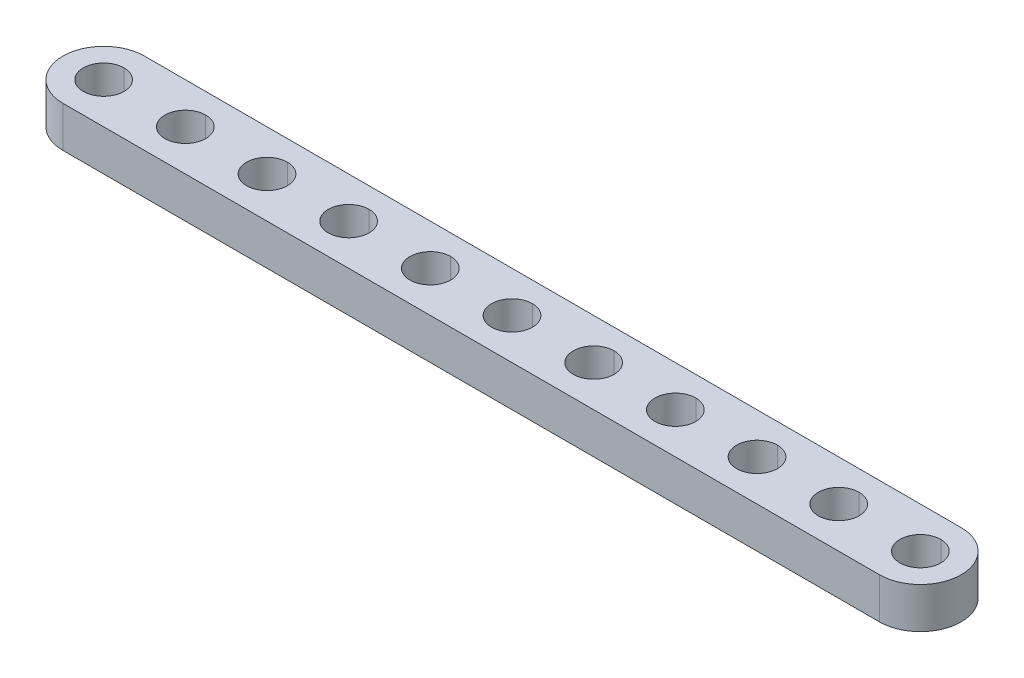
ISO-10303-21;
HEADER;
FILE_DESCRIPTION(('STEP AP214'),'2;1');
FILE_NAME('part.step','',(''),(''),'','','');
FILE_SCHEMA(('AUTOMOTIVE_DESIGN { 1 0 10303 214 1 1 1 1 }'));
ENDSEC;
DATA;
#1=APPLICATION_CONTEXT('core data for automotive mechanical design processes');
#2=APPLICATION_PROTOCOL_DEFINITION('international standard','automotive_design',2000,#1);
#3=PRODUCT_CONTEXT('',#1,'mechanical');
#4=PRODUCT('Part','Part','',(#3));
#5=PRODUCT_RELATED_PRODUCT_CATEGORY('part','',(#4));
#6=PRODUCT_DEFINITION_FORMATION('','',#4);
#7=PRODUCT_DEFINITION_CONTEXT('part definition',#1,'design');
#8=PRODUCT_DEFINITION('design','',#6,#7);
#9=PRODUCT_DEFINITION_SHAPE('','',#8);
#10=(LENGTH_UNIT() NAMED_UNIT(*) SI_UNIT(.MILLI.,.METRE.));
#11=(NAMED_UNIT(*) PLANE_ANGLE_UNIT() SI_UNIT($,.RADIAN.));
#12=(NAMED_UNIT(*) SI_UNIT($,.STERADIAN.) SOLID_ANGLE_UNIT());
#13=UNCERTAINTY_MEASURE_WITH_UNIT(LENGTH_MEASURE(1.E-05),#10,'distance_accuracy_value','');
#14=(GEOMETRIC_REPRESENTATION_CONTEXT(3) GLOBAL_UNCERTAINTY_ASSIGNED_CONTEXT((#13)) GLOBAL_UNIT_ASSIGNED_CONTEXT((#10,
#11,#12)) REPRESENTATION_CONTEXT('',''));
#15=CARTESIAN_POINT('',(0.,0.,0.));
#16=DIRECTION('',(0.,0.,1.));
#17=DIRECTION('',(1.,0.,0.));
#18=AXIS2_PLACEMENT_3D('',#15,#16,#17);
#19=CARTESIAN_POINT('',(40.,4.,0.));
#20=DIRECTION('',(0.,1.,0.));
#21=DIRECTION('',(0.,0.,1.));
#22=AXIS2_PLACEMENT_3D('',#19,#20,#21);
#23=CYLINDRICAL_SURFACE('',#22,2.);
#24=DIRECTION('',(0.,1.,0.));
#25=VECTOR('',#24,1.);
#26=CARTESIAN_POINT('',(40.,4.,-2.));
#27=LINE('',#26,#25);
#28=CARTESIAN_POINT('',(40.,0.,-2.));
#29=VERTEX_POINT('',#28);
#30=CARTESIAN_POINT('',(40.,4.,-2.));
#31=VERTEX_POINT('',#30);
#32=EDGE_CURVE('E334',#29,#31,#27,.T.);
#33=ORIENTED_EDGE('',*,*,#32,.F.);
#34=CARTESIAN_POINT('',(40.,0.,0.));
#35=DIRECTION('',(0.,1.,0.));
#36=DIRECTION('',(0.,0.,1.));
#37=AXIS2_PLACEMENT_3D('',#34,#35,#36);
#38=CIRCLE('',#37,2.);
#39=CARTESIAN_POINT('',(40.,0.,2.));
#40=VERTEX_POINT('',#39);
#41=EDGE_CURVE('E340',#40,#29,#38,.T.);
#42=ORIENTED_EDGE('',*,*,#41,.F.);
#43=DIRECTION('',(0.,1.,0.));
#44=VECTOR('',#43,1.);
#45=CARTESIAN_POINT('',(40.,4.,2.));
#46=LINE('',#45,#44);
#47=CARTESIAN_POINT('',(40.,4.,2.));
#48=VERTEX_POINT('',#47);
#49=EDGE_CURVE('E371',#40,#48,#46,.T.);
#50=ORIENTED_EDGE('',*,*,#49,.T.);
#51=CARTESIAN_POINT('',(40.,4.,0.));
#52=DIRECTION('',(0.,1.,0.));
#53=DIRECTION('',(0.,0.,1.));
#54=AXIS2_PLACEMENT_3D('',#51,#52,#53);
#55=CIRCLE('',#54,2.);
#56=EDGE_CURVE('E259',#48,#31,#55,.T.);
#57=ORIENTED_EDGE('',*,*,#56,.T.);
#58=EDGE_LOOP('',(#33,#42,#50,#57));
#59=FACE_BOUND('',#58,.T.);
#60=ADVANCED_FACE('F14',(#59),#23,.F.);
#61=CARTESIAN_POINT('',(32.,4.,0.));
#62=DIRECTION('',(0.,1.,0.));
#63=DIRECTION('',(0.,0.,1.));
#64=AXIS2_PLACEMENT_3D('',#61,#62,#63);
#65=CYLINDRICAL_SURFACE('',#64,2.);
#66=DIRECTION('',(0.,1.,0.));
#67=VECTOR('',#66,1.);
#68=CARTESIAN_POINT('',(32.,4.,-2.));
#69=LINE('',#68,#67);
#70=CARTESIAN_POINT('',(32.,0.,-2.));
#71=VERTEX_POINT('',#70);
#72=CARTESIAN_POINT('',(32.,4.,-2.));
#73=VERTEX_POINT('',#72);
#74=EDGE_CURVE('E329',#71,#73,#69,.T.);
#75=ORIENTED_EDGE('',*,*,#74,.F.);
#76=CARTESIAN_POINT('',(32.,0.,0.));
#77=DIRECTION('',(0.,1.,0.));
#78=DIRECTION('',(0.,0.,1.));
#79=AXIS2_PLACEMENT_3D('',#76,#77,#78);
#80=CIRCLE('',#79,2.);
#81=CARTESIAN_POINT('',(32.,0.,2.));
#82=VERTEX_POINT('',#81);
#83=EDGE_CURVE('E335',#82,#71,#80,.T.);
#84=ORIENTED_EDGE('',*,*,#83,.F.);
#85=DIRECTION('',(0.,1.,0.));
#86=VECTOR('',#85,1.);
#87=CARTESIAN_POINT('',(32.,4.,2.));
#88=LINE('',#87,#86);
#89=CARTESIAN_POINT('',(32.,4.,2.));
#90=VERTEX_POINT('',#89);
#91=EDGE_CURVE('E266',#82,#90,#88,.T.);
#92=ORIENTED_EDGE('',*,*,#91,.T.);
#93=CARTESIAN_POINT('',(32.,4.,0.));
#94=DIRECTION('',(0.,1.,0.));
#95=DIRECTION('',(0.,0.,1.));
#96=AXIS2_PLACEMENT_3D('',#93,#94,#95);
#97=CIRCLE('',#96,2.);
#98=EDGE_CURVE('E261',#90,#73,#97,.T.);
#99=ORIENTED_EDGE('',*,*,#98,.T.);
#100=EDGE_LOOP('',(#75,#84,#92,#99));
#101=FACE_BOUND('',#100,.T.);
#102=ADVANCED_FACE('F563',(#101),#65,.F.);
#103=CARTESIAN_POINT('',(24.,4.,0.));
#104=DIRECTION('',(0.,1.,0.));
#105=DIRECTION('',(0.,0.,1.));
#106=AXIS2_PLACEMENT_3D('',#103,#104,#105);
#107=CYLINDRICAL_SURFACE('',#106,2.);
#108=DIRECTION('',(0.,1.,0.));
#109=VECTOR('',#108,1.);
#110=CARTESIAN_POINT('',(24.,4.,-2.));
#111=LINE('',#110,#109);
#112=CARTESIAN_POINT('',(24.,0.,-2.));
#113=VERTEX_POINT('',#112);
#114=CARTESIAN_POINT('',(24.,4.,-2.));
#115=VERTEX_POINT('',#114);
#116=EDGE_CURVE('E452',#113,#115,#111,.T.);
#117=ORIENTED_EDGE('',*,*,#116,.F.);
#118=CARTESIAN_POINT('',(24.,0.,0.));
#119=DIRECTION('',(0.,1.,0.));
#120=DIRECTION('',(0.,0.,1.));
#121=AXIS2_PLACEMENT_3D('',#118,#119,#120);
#122=CIRCLE('',#121,2.);
#123=CARTESIAN_POINT('',(24.,0.,2.));
#124=VERTEX_POINT('',#123);
#125=EDGE_CURVE('E339',#124,#113,#122,.T.);
#126=ORIENTED_EDGE('',*,*,#125,.F.);
#127=DIRECTION('',(0.,1.,0.));
#128=VECTOR('',#127,1.);
#129=CARTESIAN_POINT('',(24.,4.,2.));
#130=LINE('',#129,#128);
#131=CARTESIAN_POINT('',(24.,4.,2.));
#132=VERTEX_POINT('',#131);
#133=EDGE_CURVE('E379',#124,#132,#130,.T.);
#134=ORIENTED_EDGE('',*,*,#133,.T.);
#135=CARTESIAN_POINT('',(24.,4.,0.));
#136=DIRECTION('',(0.,1.,0.));
#137=DIRECTION('',(0.,0.,1.));
#138=AXIS2_PLACEMENT_3D('',#135,#136,#137);
#139=CIRCLE('',#138,2.);
#140=EDGE_CURVE('E262',#132,#115,#139,.T.);
#141=ORIENTED_EDGE('',*,*,#140,.T.);
#142=EDGE_LOOP('',(#117,#126,#134,#141));
#143=FACE_BOUND('',#142,.T.);
#144=ADVANCED_FACE('F569',(#143),#107,.F.);
#145=CARTESIAN_POINT('',(16.,4.,0.));
#146=DIRECTION('',(0.,1.,0.));
#147=DIRECTION('',(0.,0.,1.));
#148=AXIS2_PLACEMENT_3D('',#145,#146,#147);
#149=CYLINDRICAL_SURFACE('',#148,2.);
#150=DIRECTION('',(0.,1.,0.));
#151=VECTOR('',#150,1.);
#152=CARTESIAN_POINT('',(16.,4.,-2.));
#153=LINE('',#152,#151);
#154=CARTESIAN_POINT('',(16.,0.,-2.));
#155=VERTEX_POINT('',#154);
#156=CARTESIAN_POINT('',(16.,4.,-2.));
#157=VERTEX_POINT('',#156);
#158=EDGE_CURVE('E394',#155,#157,#153,.T.);
#159=ORIENTED_EDGE('',*,*,#158,.F.);
#160=CARTESIAN_POINT('',(16.,0.,0.));
#161=DIRECTION('',(0.,1.,0.));
#162=DIRECTION('',(0.,0.,1.));
#163=AXIS2_PLACEMENT_3D('',#160,#161,#162);
#164=CIRCLE('',#163,2.);
#165=CARTESIAN_POINT('',(16.,0.,2.));
#166=VERTEX_POINT('',#165);
#167=EDGE_CURVE('E230',#166,#155,#164,.T.);
#168=ORIENTED_EDGE('',*,*,#167,.F.);
#169=DIRECTION('',(0.,1.,0.));
#170=VECTOR('',#169,1.);
#171=CARTESIAN_POINT('',(16.,4.,2.));
#172=LINE('',#171,#170);
#173=CARTESIAN_POINT('',(16.,4.,2.));
#174=VERTEX_POINT('',#173);
#175=EDGE_CURVE('E243',#166,#174,#172,.T.);
#176=ORIENTED_EDGE('',*,*,#175,.T.);
#177=CARTESIAN_POINT('',(16.,4.,0.));
#178=DIRECTION('',(0.,1.,0.));
#179=DIRECTION('',(0.,0.,1.));
#180=AXIS2_PLACEMENT_3D('',#177,#178,#179);
#181=CIRCLE('',#180,2.);
#182=EDGE_CURVE('E265',#174,#157,#181,.T.);
#183=ORIENTED_EDGE('',*,*,#182,.T.);
#184=EDGE_LOOP('',(#159,#168,#176,#183));
#185=FACE_BOUND('',#184,.T.);
#186=ADVANCED_FACE('F587',(#185),#149,.F.);
#187=CARTESIAN_POINT('',(8.,4.,0.));
#188=DIRECTION('',(0.,1.,0.));
#189=DIRECTION('',(0.,0.,1.));
#190=AXIS2_PLACEMENT_3D('',#187,#188,#189);
#191=CYLINDRICAL_SURFACE('',#190,2.);
#192=DIRECTION('',(0.,1.,0.));
#193=VECTOR('',#192,1.);
#194=CARTESIAN_POINT('',(8.,4.,-2.));
#195=LINE('',#194,#193);
#196=CARTESIAN_POINT('',(8.,0.,-2.));
#197=VERTEX_POINT('',#196);
#198=CARTESIAN_POINT('',(8.,4.,-2.));
#199=VERTEX_POINT('',#198);
#200=EDGE_CURVE('E224',#197,#199,#195,.T.);
#201=ORIENTED_EDGE('',*,*,#200,.F.);
#202=CARTESIAN_POINT('',(8.,0.,0.));
#203=DIRECTION('',(0.,1.,0.));
#204=DIRECTION('',(0.,0.,1.));
#205=AXIS2_PLACEMENT_3D('',#202,#203,#204);
#206=CIRCLE('',#205,2.);
#207=CARTESIAN_POINT('',(8.,0.,2.));
#208=VERTEX_POINT('',#207);
#209=EDGE_CURVE('E218',#208,#197,#206,.T.);
#210=ORIENTED_EDGE('',*,*,#209,.F.);
#211=DIRECTION('',(0.,1.,0.));
#212=VECTOR('',#211,1.);
#213=CARTESIAN_POINT('',(8.,4.,2.));
#214=LINE('',#213,#212);
#215=CARTESIAN_POINT('',(8.,4.,2.));
#216=VERTEX_POINT('',#215);
#217=EDGE_CURVE('E221',#208,#216,#214,.T.);
#218=ORIENTED_EDGE('',*,*,#217,.T.);
#219=CARTESIAN_POINT('',(8.,4.,0.));
#220=DIRECTION('',(0.,1.,0.));
#221=DIRECTION('',(0.,0.,1.));
#222=AXIS2_PLACEMENT_3D('',#219,#220,#221);
#223=CIRCLE('',#222,2.);
#224=EDGE_CURVE('E323',#216,#199,#223,.T.);
#225=ORIENTED_EDGE('',*,*,#224,.T.);
#226=EDGE_LOOP('',(#201,#210,#218,#225));
#227=FACE_BOUND('',#226,.T.);
#228=ADVANCED_FACE('F220',(#227),#191,.F.);
#229=CARTESIAN_POINT('',(0.,4.,0.));
#230=DIRECTION('',(0.,1.,0.));
#231=DIRECTION('',(0.,0.,1.));
#232=AXIS2_PLACEMENT_3D('',#229,#230,#231);
#233=CYLINDRICAL_SURFACE('',#232,2.);
#234=DIRECTION('',(0.,1.,0.));
#235=VECTOR('',#234,1.);
#236=CARTESIAN_POINT('',(0.,4.,-2.));
#237=LINE('',#236,#235);
#238=CARTESIAN_POINT('',(0.,0.,-2.));
#239=VERTEX_POINT('',#238);
#240=CARTESIAN_POINT('',(0.,4.,-2.));
#241=VERTEX_POINT('',#240);
#242=EDGE_CURVE('E283',#239,#241,#237,.T.);
#243=ORIENTED_EDGE('',*,*,#242,.F.);
#244=CARTESIAN_POINT('',(0.,0.,0.));
#245=DIRECTION('',(0.,1.,0.));
#246=DIRECTION('',(0.,0.,1.));
#247=AXIS2_PLACEMENT_3D('',#244,#245,#246);
#248=CIRCLE('',#247,2.);
#249=CARTESIAN_POINT('',(0.,0.,2.));
#250=VERTEX_POINT('',#249);
#251=EDGE_CURVE('E229',#250,#239,#248,.T.);
#252=ORIENTED_EDGE('',*,*,#251,.F.);
#253=DIRECTION('',(0.,1.,0.));
#254=VECTOR('',#253,1.);
#255=CARTESIAN_POINT('',(0.,4.,2.));
#256=LINE('',#255,#254);
#257=CARTESIAN_POINT('',(0.,4.,2.));
#258=VERTEX_POINT('',#257);
#259=EDGE_CURVE('E301',#250,#258,#256,.T.);
#260=ORIENTED_EDGE('',*,*,#259,.T.);
#261=CARTESIAN_POINT('',(0.,4.,0.));
#262=DIRECTION('',(0.,1.,0.));
#263=DIRECTION('',(0.,0.,1.));
#264=AXIS2_PLACEMENT_3D('',#261,#262,#263);
#265=CIRCLE('',#264,2.);
#266=EDGE_CURVE('E319',#258,#241,#265,.T.);
#267=ORIENTED_EDGE('',*,*,#266,.T.);
#268=EDGE_LOOP('',(#243,#252,#260,#267));
#269=FACE_BOUND('',#268,.T.);
#270=ADVANCED_FACE('F579',(#269),#233,.F.);
#271=CARTESIAN_POINT('',(-8.,4.,0.));
#272=DIRECTION('',(0.,1.,0.));
#273=DIRECTION('',(0.,0.,1.));
#274=AXIS2_PLACEMENT_3D('',#271,#272,#273);
#275=CYLINDRICAL_SURFACE('',#274,2.);
#276=DIRECTION('',(0.,1.,0.));
#277=VECTOR('',#276,1.);
#278=CARTESIAN_POINT('',(-8.,4.,-2.));
#279=LINE('',#278,#277);
#280=CARTESIAN_POINT('',(-8.,0.,-2.));
#281=VERTEX_POINT('',#280);
#282=CARTESIAN_POINT('',(-8.,4.,-2.));
#283=VERTEX_POINT('',#282);
#284=EDGE_CURVE('E309',#281,#283,#279,.T.);
#285=ORIENTED_EDGE('',*,*,#284,.F.);
#286=CARTESIAN_POINT('',(-8.,0.,0.));
#287=DIRECTION('',(0.,1.,0.));
#288=DIRECTION('',(0.,0.,1.));
#289=AXIS2_PLACEMENT_3D('',#286,#287,#288);
#290=CIRCLE('',#289,2.);
#291=CARTESIAN_POINT('',(-8.,0.,2.));
#292=VERTEX_POINT('',#291);
#293=EDGE_CURVE('E282',#292,#281,#290,.T.);
#294=ORIENTED_EDGE('',*,*,#293,.F.);
#295=DIRECTION('',(0.,1.,0.));
#296=VECTOR('',#295,1.);
#297=CARTESIAN_POINT('',(-8.,4.,2.));
#298=LINE('',#297,#296);
#299=CARTESIAN_POINT('',(-8.,4.,2.));
#300=VERTEX_POINT('',#299);
#301=EDGE_CURVE('E313',#292,#300,#298,.T.);
#302=ORIENTED_EDGE('',*,*,#301,.T.);
#303=CARTESIAN_POINT('',(-8.,4.,0.));
#304=DIRECTION('',(0.,1.,0.));
#305=DIRECTION('',(0.,0.,1.));
#306=AXIS2_PLACEMENT_3D('',#303,#304,#305);
#307=CIRCLE('',#306,2.);
#308=EDGE_CURVE('E322',#300,#283,#307,.T.);
#309=ORIENTED_EDGE('',*,*,#308,.T.);
#310=EDGE_LOOP('',(#285,#294,#302,#309));
#311=FACE_BOUND('',#310,.T.);
#312=ADVANCED_FACE('F576',(#311),#275,.F.);
#313=CARTESIAN_POINT('',(-16.,4.,0.));
#314=DIRECTION('',(0.,1.,0.));
#315=DIRECTION('',(0.,0.,1.));
#316=AXIS2_PLACEMENT_3D('',#313,#314,#315);
#317=CYLINDRICAL_SURFACE('',#316,2.);
#318=DIRECTION('',(0.,1.,0.));
#319=VECTOR('',#318,1.);
#320=CARTESIAN_POINT('',(-16.,4.,-2.));
#321=LINE('',#320,#319);
#322=CARTESIAN_POINT('',(-16.,0.,-2.));
#323=VERTEX_POINT('',#322);
#324=CARTESIAN_POINT('',(-16.,4.,-2.));
#325=VERTEX_POINT('',#324);
#326=EDGE_CURVE('E431',#323,#325,#321,.T.);
#327=ORIENTED_EDGE('',*,*,#326,.F.);
#328=CARTESIAN_POINT('',(-16.,0.,0.));
#329=DIRECTION('',(0.,1.,0.));
#330=DIRECTION('',(0.,0.,1.));
#331=AXIS2_PLACEMENT_3D('',#328,#329,#330);
#332=CIRCLE('',#331,2.);
#333=CARTESIAN_POINT('',(-16.,0.,2.));
#334=VERTEX_POINT('',#333);
#335=EDGE_CURVE('E278',#334,#323,#332,.T.);
#336=ORIENTED_EDGE('',*,*,#335,.F.);
#337=DIRECTION('',(0.,1.,0.));
#338=VECTOR('',#337,1.);
#339=CARTESIAN_POINT('',(-16.,4.,2.));
#340=LINE('',#339,#338);
#341=CARTESIAN_POINT('',(-16.,4.,2.));
#342=VERTEX_POINT('',#341);
#343=EDGE_CURVE('E385',#334,#342,#340,.T.);
#344=ORIENTED_EDGE('',*,*,#343,.T.);
#345=CARTESIAN_POINT('',(-16.,4.,0.));
#346=DIRECTION('',(0.,1.,0.));
#347=DIRECTION('',(0.,0.,1.));
#348=AXIS2_PLACEMENT_3D('',#345,#346,#347);
#349=CIRCLE('',#348,2.);
#350=EDGE_CURVE('E400',#342,#325,#349,.T.);
#351=ORIENTED_EDGE('',*,*,#350,.T.);
#352=EDGE_LOOP('',(#327,#336,#344,#351));
#353=FACE_BOUND('',#352,.T.);
#354=ADVANCED_FACE('F578',(#353),#317,.F.);
#355=CARTESIAN_POINT('',(-24.,4.,0.));
#356=DIRECTION('',(0.,1.,0.));
#357=DIRECTION('',(0.,0.,1.));
#358=AXIS2_PLACEMENT_3D('',#355,#356,#357);
#359=CYLINDRICAL_SURFACE('',#358,2.);
#360=DIRECTION('',(0.,1.,0.));
#361=VECTOR('',#360,1.);
#362=CARTESIAN_POINT('',(-24.,4.,-2.));
#363=LINE('',#362,#361);
#364=CARTESIAN_POINT('',(-24.,0.,-2.));
#365=VERTEX_POINT('',#364);
#366=CARTESIAN_POINT('',(-24.,4.,-2.));
#367=VERTEX_POINT('',#366);
#368=EDGE_CURVE('E356',#365,#367,#363,.T.);
#369=ORIENTED_EDGE('',*,*,#368,.F.);
#370=CARTESIAN_POINT('',(-24.,0.,0.));
#371=DIRECTION('',(0.,1.,0.));
#372=DIRECTION('',(0.,0.,1.));
#373=AXIS2_PLACEMENT_3D('',#370,#371,#372);
#374=CIRCLE('',#373,2.);
#375=CARTESIAN_POINT('',(-24.,0.,2.));
#376=VERTEX_POINT('',#375);
#377=EDGE_CURVE('E281',#376,#365,#374,.T.);
#378=ORIENTED_EDGE('',*,*,#377,.F.);
#379=DIRECTION('',(0.,1.,0.));
#380=VECTOR('',#379,1.);
#381=CARTESIAN_POINT('',(-24.,4.,2.));
#382=LINE('',#381,#380);
#383=CARTESIAN_POINT('',(-24.,4.,2.));
#384=VERTEX_POINT('',#383);
#385=EDGE_CURVE('E288',#376,#384,#382,.T.);
#386=ORIENTED_EDGE('',*,*,#385,.T.);
#387=CARTESIAN_POINT('',(-24.,4.,0.));
#388=DIRECTION('',(0.,1.,0.));
#389=DIRECTION('',(0.,0.,1.));
#390=AXIS2_PLACEMENT_3D('',#387,#388,#389);
#391=CIRCLE('',#390,2.);
#392=EDGE_CURVE('E404',#384,#367,#391,.T.);
#393=ORIENTED_EDGE('',*,*,#392,.T.);
#394=EDGE_LOOP('',(#369,#378,#386,#393));
#395=FACE_BOUND('',#394,.T.);
#396=ADVANCED_FACE('F516',(#395),#359,.F.);
#397=CARTESIAN_POINT('',(-32.,4.,0.));
#398=DIRECTION('',(0.,1.,0.));
#399=DIRECTION('',(0.,0.,1.));
#400=AXIS2_PLACEMENT_3D('',#397,#398,#399);
#401=CYLINDRICAL_SURFACE('',#400,2.);
#402=DIRECTION('',(0.,1.,0.));
#403=VECTOR('',#402,1.);
#404=CARTESIAN_POINT('',(-32.,4.,-2.));
#405=LINE('',#404,#403);
#406=CARTESIAN_POINT('',(-32.,0.,-2.));
#407=VERTEX_POINT('',#406);
#408=CARTESIAN_POINT('',(-32.,4.,-2.));
#409=VERTEX_POINT('',#408);
#410=EDGE_CURVE('E344',#407,#409,#405,.T.);
#411=ORIENTED_EDGE('',*,*,#410,.F.);
#412=CARTESIAN_POINT('',(-32.,0.,0.));
#413=DIRECTION('',(0.,1.,0.));
#414=DIRECTION('',(0.,0.,1.));
#415=AXIS2_PLACEMENT_3D('',#412,#413,#414);
#416=CIRCLE('',#415,2.);
#417=CARTESIAN_POINT('',(-32.,0.,2.));
#418=VERTEX_POINT('',#417);
#419=EDGE_CURVE('E25',#418,#407,#416,.T.);
#420=ORIENTED_EDGE('',*,*,#419,.F.);
#421=DIRECTION('',(0.,1.,0.));
#422=VECTOR('',#421,1.);
#423=CARTESIAN_POINT('',(-32.,4.,2.));
#424=LINE('',#423,#422);
#425=CARTESIAN_POINT('',(-32.,4.,2.));
#426=VERTEX_POINT('',#425);
#427=EDGE_CURVE('E257',#418,#426,#424,.T.);
#428=ORIENTED_EDGE('',*,*,#427,.T.);
#429=CARTESIAN_POINT('',(-32.,4.,0.));
#430=DIRECTION('',(0.,1.,0.));
#431=DIRECTION('',(0.,0.,1.));
#432=AXIS2_PLACEMENT_3D('',#429,#430,#431);
#433=CIRCLE('',#432,2.);
#434=EDGE_CURVE('E407',#426,#409,#433,.T.);
#435=ORIENTED_EDGE('',*,*,#434,.T.);
#436=EDGE_LOOP('',(#411,#420,#428,#435));
#437=FACE_BOUND('',#436,.T.);
#438=ADVANCED_FACE('F735',(#437),#401,.F.);
#439=CARTESIAN_POINT('',(-40.,4.,0.));
#440=DIRECTION('',(0.,1.,0.));
#441=DIRECTION('',(0.,0.,1.));
#442=AXIS2_PLACEMENT_3D('',#439,#440,#441);
#443=CYLINDRICAL_SURFACE('',#442,2.);
#444=DIRECTION('',(0.,1.,0.));
#445=VECTOR('',#444,1.);
#446=CARTESIAN_POINT('',(-40.,4.,-2.));
#447=LINE('',#446,#445);
#448=CARTESIAN_POINT('',(-40.,0.,-2.));
#449=VERTEX_POINT('',#448);
#450=CARTESIAN_POINT('',(-40.,4.,-2.));
#451=VERTEX_POINT('',#450);
#452=EDGE_CURVE('E361',#449,#451,#447,.T.);
#453=ORIENTED_EDGE('',*,*,#452,.F.);
#454=CARTESIAN_POINT('',(-40.,0.,0.));
#455=DIRECTION('',(0.,1.,0.));
#456=DIRECTION('',(0.,0.,1.));
#457=AXIS2_PLACEMENT_3D('',#454,#455,#456);
#458=CIRCLE('',#457,2.);
#459=CARTESIAN_POINT('',(-40.,0.,2.));
#460=VERTEX_POINT('',#459);
#461=EDGE_CURVE('E9',#460,#449,#458,.T.);
#462=ORIENTED_EDGE('',*,*,#461,.F.);
#463=DIRECTION('',(0.,1.,0.));
#464=VECTOR('',#463,1.);
#465=CARTESIAN_POINT('',(-40.,4.,2.));
#466=LINE('',#465,#464);
#467=CARTESIAN_POINT('',(-40.,4.,2.));
#468=VERTEX_POINT('',#467);
#469=EDGE_CURVE('E459',#460,#468,#466,.T.);
#470=ORIENTED_EDGE('',*,*,#469,.T.);
#471=CARTESIAN_POINT('',(-40.,4.,0.));
#472=DIRECTION('',(0.,1.,0.));
#473=DIRECTION('',(0.,0.,1.));
#474=AXIS2_PLACEMENT_3D('',#471,#472,#473);
#475=CIRCLE('',#474,2.);
#476=EDGE_CURVE('E409',#468,#451,#475,.T.);
#477=ORIENTED_EDGE('',*,*,#476,.T.);
#478=EDGE_LOOP('',(#453,#462,#470,#477));
#479=FACE_BOUND('',#478,.T.);
#480=ADVANCED_FACE('F16',(#479),#443,.F.);
#481=CARTESIAN_POINT('',(-40.,0.,0.));
#482=DIRECTION('',(0.,1.,0.));
#483=DIRECTION('',(1.,0.,0.));
#484=AXIS2_PLACEMENT_3D('',#481,#482,#483);
#485=PLANE('',#484);
#486=ORIENTED_EDGE('',*,*,#461,.T.);
#487=CARTESIAN_POINT('',(-40.,0.,0.));
#488=DIRECTION('',(0.,1.,0.));
#489=DIRECTION('',(0.,0.,1.));
#490=AXIS2_PLACEMENT_3D('',#487,#488,#489);
#491=CIRCLE('',#490,2.);
#492=EDGE_CURVE('E366',#449,#460,#491,.T.);
#493=ORIENTED_EDGE('',*,*,#492,.T.);
#494=EDGE_LOOP('',(#486,#493));
#495=FACE_BOUND('',#494,.T.);
#496=ORIENTED_EDGE('',*,*,#419,.T.);
#497=CARTESIAN_POINT('',(-32.,0.,0.));
#498=DIRECTION('',(0.,1.,0.));
#499=DIRECTION('',(0.,0.,1.));
#500=AXIS2_PLACEMENT_3D('',#497,#498,#499);
#501=CIRCLE('',#500,2.);
#502=EDGE_CURVE('E292',#407,#418,#501,.T.);
#503=ORIENTED_EDGE('',*,*,#502,.T.);
#504=EDGE_LOOP('',(#496,#503));
#505=FACE_BOUND('',#504,.T.);
#506=ORIENTED_EDGE('',*,*,#377,.T.);
#507=CARTESIAN_POINT('',(-24.,0.,0.));
#508=DIRECTION('',(0.,1.,0.));
#509=DIRECTION('',(0.,0.,1.));
#510=AXIS2_PLACEMENT_3D('',#507,#508,#509);
#511=CIRCLE('',#510,2.);
#512=EDGE_CURVE('E360',#365,#376,#511,.T.);
#513=ORIENTED_EDGE('',*,*,#512,.T.);
#514=EDGE_LOOP('',(#506,#513));
#515=FACE_BOUND('',#514,.T.);
#516=ORIENTED_EDGE('',*,*,#335,.T.);
#517=CARTESIAN_POINT('',(-16.,0.,0.));
#518=DIRECTION('',(0.,1.,0.));
#519=DIRECTION('',(0.,0.,1.));
#520=AXIS2_PLACEMENT_3D('',#517,#518,#519);
#521=CIRCLE('',#520,2.);
#522=EDGE_CURVE('E317',#323,#334,#521,.T.);
#523=ORIENTED_EDGE('',*,*,#522,.T.);
#524=EDGE_LOOP('',(#516,#523));
#525=FACE_BOUND('',#524,.T.);
#526=ORIENTED_EDGE('',*,*,#293,.T.);
#527=CARTESIAN_POINT('',(-8.,0.,0.));
#528=DIRECTION('',(0.,1.,0.));
#529=DIRECTION('',(0.,0.,1.));
#530=AXIS2_PLACEMENT_3D('',#527,#528,#529);
#531=CIRCLE('',#530,2.);
#532=EDGE_CURVE('E305',#281,#292,#531,.T.);
#533=ORIENTED_EDGE('',*,*,#532,.T.);
#534=EDGE_LOOP('',(#526,#533));
#535=FACE_BOUND('',#534,.T.);
#536=ORIENTED_EDGE('',*,*,#251,.T.);
#537=CARTESIAN_POINT('',(0.,0.,0.));
#538=DIRECTION('',(0.,1.,0.));
#539=DIRECTION('',(0.,0.,1.));
#540=AXIS2_PLACEMENT_3D('',#537,#538,#539);
#541=CIRCLE('',#540,2.);
#542=EDGE_CURVE('E238',#239,#250,#541,.T.);
#543=ORIENTED_EDGE('',*,*,#542,.T.);
#544=EDGE_LOOP('',(#536,#543));
#545=FACE_BOUND('',#544,.T.);
#546=ORIENTED_EDGE('',*,*,#209,.T.);
#547=CARTESIAN_POINT('',(8.,0.,0.));
#548=DIRECTION('',(0.,1.,0.));
#549=DIRECTION('',(0.,0.,1.));
#550=AXIS2_PLACEMENT_3D('',#547,#548,#549);
#551=CIRCLE('',#550,2.);
#552=EDGE_CURVE('E234',#197,#208,#551,.T.);
#553=ORIENTED_EDGE('',*,*,#552,.T.);
#554=EDGE_LOOP('',(#546,#553));
#555=FACE_BOUND('',#554,.T.);
#556=ORIENTED_EDGE('',*,*,#167,.T.);
#557=CARTESIAN_POINT('',(16.,0.,0.));
#558=DIRECTION('',(0.,1.,0.));
#559=DIRECTION('',(0.,0.,1.));
#560=AXIS2_PLACEMENT_3D('',#557,#558,#559);
#561=CIRCLE('',#560,2.);
#562=EDGE_CURVE('E383',#155,#166,#561,.T.);
#563=ORIENTED_EDGE('',*,*,#562,.T.);
#564=EDGE_LOOP('',(#556,#563));
#565=FACE_BOUND('',#564,.T.);
#566=ORIENTED_EDGE('',*,*,#125,.T.);
#567=CARTESIAN_POINT('',(24.,0.,0.));
#568=DIRECTION('',(0.,1.,0.));
#569=DIRECTION('',(0.,0.,1.));
#570=AXIS2_PLACEMENT_3D('',#567,#568,#569);
#571=CIRCLE('',#570,2.);
#572=EDGE_CURVE('E270',#113,#124,#571,.T.);
#573=ORIENTED_EDGE('',*,*,#572,.T.);
#574=EDGE_LOOP('',(#566,#573));
#575=FACE_BOUND('',#574,.T.);
#576=ORIENTED_EDGE('',*,*,#83,.T.);
#577=CARTESIAN_POINT('',(32.,0.,0.));
#578=DIRECTION('',(0.,1.,0.));
#579=DIRECTION('',(0.,0.,1.));
#580=AXIS2_PLACEMENT_3D('',#577,#578,#579);
#581=CIRCLE('',#580,2.);
#582=EDGE_CURVE('E367',#71,#82,#581,.T.);
#583=ORIENTED_EDGE('',*,*,#582,.T.);
#584=EDGE_LOOP('',(#576,#583));
#585=FACE_BOUND('',#584,.T.);
#586=ORIENTED_EDGE('',*,*,#41,.T.);
#587=CARTESIAN_POINT('',(40.,0.,0.));
#588=DIRECTION('',(0.,1.,0.));
#589=DIRECTION('',(0.,0.,1.));
#590=AXIS2_PLACEMENT_3D('',#587,#588,#589);
#591=CIRCLE('',#590,2.);
#592=EDGE_CURVE('E330',#29,#40,#591,.T.);
#593=ORIENTED_EDGE('',*,*,#592,.T.);
#594=EDGE_LOOP('',(#586,#593));
#595=FACE_BOUND('',#594,.T.);
#596=CARTESIAN_POINT('',(-40.,0.,0.));
#597=DIRECTION('',(0.,1.,0.));
#598=DIRECTION('',(0.,0.,1.));
#599=AXIS2_PLACEMENT_3D('',#596,#597,#598);
#600=CIRCLE('',#599,4.);
#601=CARTESIAN_POINT('',(-40.,0.,-4.));
#602=VERTEX_POINT('',#601);
#603=CARTESIAN_POINT('',(-40.,0.,4.));
#604=VERTEX_POINT('',#603);
#605=EDGE_CURVE('E352',#602,#604,#600,.T.);
#606=ORIENTED_EDGE('',*,*,#605,.F.);
#607=DIRECTION('',(-1.,0.,0.));
#608=VECTOR('',#607,1.);
#609=CARTESIAN_POINT('',(-40.,0.,-4.));
#610=LINE('',#609,#608);
#611=CARTESIAN_POINT('',(40.,0.,-4.));
#612=VERTEX_POINT('',#611);
#613=EDGE_CURVE('E104',#612,#602,#610,.T.);
#614=ORIENTED_EDGE('',*,*,#613,.F.);
#615=CARTESIAN_POINT('',(40.,0.,0.));
#616=DIRECTION('',(0.,1.,0.));
#617=DIRECTION('',(0.,0.,1.));
#618=AXIS2_PLACEMENT_3D('',#615,#616,#617);
#619=CIRCLE('',#618,4.);
#620=CARTESIAN_POINT('',(40.,0.,4.));
#621=VERTEX_POINT('',#620);
#622=EDGE_CURVE('E272',#621,#612,#619,.T.);
#623=ORIENTED_EDGE('',*,*,#622,.F.);
#624=DIRECTION('',(1.,0.,0.));
#625=VECTOR('',#624,1.);
#626=CARTESIAN_POINT('',(-40.,0.,4.));
#627=LINE('',#626,#625);
#628=EDGE_CURVE('E92',#604,#621,#627,.T.);
#629=ORIENTED_EDGE('',*,*,#628,.F.);
#630=EDGE_LOOP('',(#606,#614,#623,#629));
#631=FACE_BOUND('',#630,.T.);
#632=ADVANCED_FACE('F240',(#495,#505,#515,#525,#535,#545,#555,#565,#575,#585,#595,#631),#485,.F.);
#633=CARTESIAN_POINT('',(-40.,4.,0.));
#634=DIRECTION('',(0.,1.,0.));
#635=DIRECTION('',(1.,0.,0.));
#636=AXIS2_PLACEMENT_3D('',#633,#634,#635);
#637=PLANE('',#636);
#638=ORIENTED_EDGE('',*,*,#476,.F.);
#639=CARTESIAN_POINT('',(-40.,4.,0.));
#640=DIRECTION('',(0.,1.,0.));
#641=DIRECTION('',(0.,0.,1.));
#642=AXIS2_PLACEMENT_3D('',#639,#640,#641);
#643=CIRCLE('',#642,2.);
#644=EDGE_CURVE('E365',#451,#468,#643,.T.);
#645=ORIENTED_EDGE('',*,*,#644,.F.);
#646=EDGE_LOOP('',(#638,#645));
#647=FACE_BOUND('',#646,.T.);
#648=ORIENTED_EDGE('',*,*,#434,.F.);
#649=CARTESIAN_POINT('',(-32.,4.,0.));
#650=DIRECTION('',(0.,1.,0.));
#651=DIRECTION('',(0.,0.,1.));
#652=AXIS2_PLACEMENT_3D('',#649,#650,#651);
#653=CIRCLE('',#652,2.);
#654=EDGE_CURVE('E469',#409,#426,#653,.T.);
#655=ORIENTED_EDGE('',*,*,#654,.F.);
#656=EDGE_LOOP('',(#648,#655));
#657=FACE_BOUND('',#656,.T.);
#658=ORIENTED_EDGE('',*,*,#392,.F.);
#659=CARTESIAN_POINT('',(-24.,4.,0.));
#660=DIRECTION('',(0.,1.,0.));
#661=DIRECTION('',(0.,0.,1.));
#662=AXIS2_PLACEMENT_3D('',#659,#660,#661);
#663=CIRCLE('',#662,2.);
#664=EDGE_CURVE('E293',#367,#384,#663,.T.);
#665=ORIENTED_EDGE('',*,*,#664,.F.);
#666=EDGE_LOOP('',(#658,#665));
#667=FACE_BOUND('',#666,.T.);
#668=ORIENTED_EDGE('',*,*,#350,.F.);
#669=CARTESIAN_POINT('',(-16.,4.,0.));
#670=DIRECTION('',(0.,1.,0.));
#671=DIRECTION('',(0.,0.,1.));
#672=AXIS2_PLACEMENT_3D('',#669,#670,#671);
#673=CIRCLE('',#672,2.);
#674=EDGE_CURVE('E18',#325,#342,#673,.T.);
#675=ORIENTED_EDGE('',*,*,#674,.F.);
#676=EDGE_LOOP('',(#668,#675));
#677=FACE_BOUND('',#676,.T.);
#678=ORIENTED_EDGE('',*,*,#308,.F.);
#679=CARTESIAN_POINT('',(-8.,4.,0.));
#680=DIRECTION('',(0.,1.,0.));
#681=DIRECTION('',(0.,0.,1.));
#682=AXIS2_PLACEMENT_3D('',#679,#680,#681);
#683=CIRCLE('',#682,2.);
#684=EDGE_CURVE('E318',#283,#300,#683,.T.);
#685=ORIENTED_EDGE('',*,*,#684,.F.);
#686=EDGE_LOOP('',(#678,#685));
#687=FACE_BOUND('',#686,.T.);
#688=ORIENTED_EDGE('',*,*,#266,.F.);
#689=CARTESIAN_POINT('',(0.,4.,0.));
#690=DIRECTION('',(0.,1.,0.));
#691=DIRECTION('',(0.,0.,1.));
#692=AXIS2_PLACEMENT_3D('',#689,#690,#691);
#693=CIRCLE('',#692,2.);
#694=EDGE_CURVE('E287',#241,#258,#693,.T.);
#695=ORIENTED_EDGE('',*,*,#694,.F.);
#696=EDGE_LOOP('',(#688,#695));
#697=FACE_BOUND('',#696,.T.);
#698=ORIENTED_EDGE('',*,*,#224,.F.);
#699=CARTESIAN_POINT('',(8.,4.,0.));
#700=DIRECTION('',(0.,1.,0.));
#701=DIRECTION('',(0.,0.,1.));
#702=AXIS2_PLACEMENT_3D('',#699,#700,#701);
#703=CIRCLE('',#702,2.);
#704=EDGE_CURVE('E236',#199,#216,#703,.T.);
#705=ORIENTED_EDGE('',*,*,#704,.F.);
#706=EDGE_LOOP('',(#698,#705));
#707=FACE_BOUND('',#706,.T.);
#708=ORIENTED_EDGE('',*,*,#182,.F.);
#709=CARTESIAN_POINT('',(16.,4.,0.));
#710=DIRECTION('',(0.,1.,0.));
#711=DIRECTION('',(0.,0.,1.));
#712=AXIS2_PLACEMENT_3D('',#709,#710,#711);
#713=CIRCLE('',#712,2.);
#714=EDGE_CURVE('E253',#157,#174,#713,.T.);
#715=ORIENTED_EDGE('',*,*,#714,.F.);
#716=EDGE_LOOP('',(#708,#715));
#717=FACE_BOUND('',#716,.T.);
#718=ORIENTED_EDGE('',*,*,#140,.F.);
#719=CARTESIAN_POINT('',(24.,4.,0.));
#720=DIRECTION('',(0.,1.,0.));
#721=DIRECTION('',(0.,0.,1.));
#722=AXIS2_PLACEMENT_3D('',#719,#720,#721);
#723=CIRCLE('',#722,2.);
#724=EDGE_CURVE('E384',#115,#132,#723,.T.);
#725=ORIENTED_EDGE('',*,*,#724,.F.);
#726=EDGE_LOOP('',(#718,#725));
#727=FACE_BOUND('',#726,.T.);
#728=ORIENTED_EDGE('',*,*,#98,.F.);
#729=CARTESIAN_POINT('',(32.,4.,0.));
#730=DIRECTION('',(0.,1.,0.));
#731=DIRECTION('',(0.,0.,1.));
#732=AXIS2_PLACEMENT_3D('',#729,#730,#731);
#733=CIRCLE('',#732,2.);
#734=EDGE_CURVE('E271',#73,#90,#733,.T.);
#735=ORIENTED_EDGE('',*,*,#734,.F.);
#736=EDGE_LOOP('',(#728,#735));
#737=FACE_BOUND('',#736,.T.);
#738=ORIENTED_EDGE('',*,*,#56,.F.);
#739=CARTESIAN_POINT('',(40.,4.,0.));
#740=DIRECTION('',(0.,1.,0.));
#741=DIRECTION('',(0.,0.,1.));
#742=AXIS2_PLACEMENT_3D('',#739,#740,#741);
#743=CIRCLE('',#742,2.);
#744=EDGE_CURVE('E378',#31,#48,#743,.T.);
#745=ORIENTED_EDGE('',*,*,#744,.F.);
#746=EDGE_LOOP('',(#738,#745));
#747=FACE_BOUND('',#746,.T.);
#748=CARTESIAN_POINT('',(-40.,4.,0.));
#749=DIRECTION('',(0.,1.,0.));
#750=DIRECTION('',(0.,0.,1.));
#751=AXIS2_PLACEMENT_3D('',#748,#749,#750);
#752=CIRCLE('',#751,4.);
#753=CARTESIAN_POINT('',(-40.,4.,-4.));
#754=VERTEX_POINT('',#753);
#755=CARTESIAN_POINT('',(-40.,4.,4.));
#756=VERTEX_POINT('',#755);
#757=EDGE_CURVE('E351',#754,#756,#752,.T.);
#758=ORIENTED_EDGE('',*,*,#757,.T.);
#759=DIRECTION('',(1.,0.,0.));
#760=VECTOR('',#759,1.);
#761=CARTESIAN_POINT('',(-40.,4.,4.));
#762=LINE('',#761,#760);
#763=CARTESIAN_POINT('',(40.,4.,4.));
#764=VERTEX_POINT('',#763);
#765=EDGE_CURVE('E277',#756,#764,#762,.T.);
#766=ORIENTED_EDGE('',*,*,#765,.T.);
#767=CARTESIAN_POINT('',(40.,4.,0.));
#768=DIRECTION('',(0.,1.,0.));
#769=DIRECTION('',(0.,0.,1.));
#770=AXIS2_PLACEMENT_3D('',#767,#768,#769);
#771=CIRCLE('',#770,4.);
#772=CARTESIAN_POINT('',(40.,4.,-4.));
#773=VERTEX_POINT('',#772);
#774=EDGE_CURVE('E300',#764,#773,#771,.T.);
#775=ORIENTED_EDGE('',*,*,#774,.T.);
#776=DIRECTION('',(-1.,0.,0.));
#777=VECTOR('',#776,1.);
#778=CARTESIAN_POINT('',(-40.,4.,-4.));
#779=LINE('',#778,#777);
#780=EDGE_CURVE('E40',#773,#754,#779,.T.);
#781=ORIENTED_EDGE('',*,*,#780,.T.);
#782=EDGE_LOOP('',(#758,#766,#775,#781));
#783=FACE_BOUND('',#782,.T.);
#784=ADVANCED_FACE('F520',(#647,#657,#667,#677,#687,#697,#707,#717,#727,#737,#747,#783),#637,.T.);
#785=CARTESIAN_POINT('',(-40.,4.,-4.));
#786=DIRECTION('',(0.,0.,1.));
#787=DIRECTION('',(1.,0.,0.));
#788=AXIS2_PLACEMENT_3D('',#785,#786,#787);
#789=PLANE('',#788);
#790=ORIENTED_EDGE('',*,*,#613,.T.);
#791=DIRECTION('',(0.,-1.,0.));
#792=VECTOR('',#791,1.);
#793=CARTESIAN_POINT('',(-40.,4.,-4.));
#794=LINE('',#793,#792);
#795=EDGE_CURVE('E372',#754,#602,#794,.T.);
#796=ORIENTED_EDGE('',*,*,#795,.F.);
#797=ORIENTED_EDGE('',*,*,#780,.F.);
#798=DIRECTION('',(0.,-1.,0.));
#799=VECTOR('',#798,1.);
#800=CARTESIAN_POINT('',(40.,4.,-4.));
#801=LINE('',#800,#799);
#802=EDGE_CURVE('E276',#773,#612,#801,.T.);
#803=ORIENTED_EDGE('',*,*,#802,.T.);
#804=EDGE_LOOP('',(#790,#796,#797,#803));
#805=FACE_BOUND('',#804,.T.);
#806=ADVANCED_FACE('F523',(#805),#789,.F.);
#807=CARTESIAN_POINT('',(40.,4.,0.));
#808=DIRECTION('',(0.,-1.,0.));
#809=DIRECTION('',(0.,0.,-1.));
#810=AXIS2_PLACEMENT_3D('',#807,#808,#809);
#811=CYLINDRICAL_SURFACE('',#810,4.);
#812=ORIENTED_EDGE('',*,*,#622,.T.);
#813=ORIENTED_EDGE('',*,*,#802,.F.);
#814=ORIENTED_EDGE('',*,*,#774,.F.);
#815=DIRECTION('',(0.,-1.,0.));
#816=VECTOR('',#815,1.);
#817=CARTESIAN_POINT('',(40.,4.,4.));
#818=LINE('',#817,#816);
#819=EDGE_CURVE('E294',#764,#621,#818,.T.);
#820=ORIENTED_EDGE('',*,*,#819,.T.);
#821=EDGE_LOOP('',(#812,#813,#814,#820));
#822=FACE_BOUND('',#821,.T.);
#823=ADVANCED_FACE('F552',(#822),#811,.T.);
#824=CARTESIAN_POINT('',(-40.,4.,4.));
#825=DIRECTION('',(0.,0.,-1.));
#826=DIRECTION('',(0.,-1.,0.));
#827=AXIS2_PLACEMENT_3D('',#824,#825,#826);
#828=PLANE('',#827);
#829=ORIENTED_EDGE('',*,*,#628,.T.);
#830=ORIENTED_EDGE('',*,*,#819,.F.);
#831=ORIENTED_EDGE('',*,*,#765,.F.);
#832=DIRECTION('',(0.,-1.,0.));
#833=VECTOR('',#832,1.);
#834=CARTESIAN_POINT('',(-40.,4.,4.));
#835=LINE('',#834,#833);
#836=EDGE_CURVE('E348',#756,#604,#835,.T.);
#837=ORIENTED_EDGE('',*,*,#836,.T.);
#838=EDGE_LOOP('',(#829,#830,#831,#837));
#839=FACE_BOUND('',#838,.T.);
#840=ADVANCED_FACE('F550',(#839),#828,.F.);
#841=CARTESIAN_POINT('',(-40.,4.,0.));
#842=DIRECTION('',(0.,-1.,0.));
#843=DIRECTION('',(0.,0.,-1.));
#844=AXIS2_PLACEMENT_3D('',#841,#842,#843);
#845=CYLINDRICAL_SURFACE('',#844,4.);
#846=ORIENTED_EDGE('',*,*,#605,.T.);
#847=ORIENTED_EDGE('',*,*,#836,.F.);
#848=ORIENTED_EDGE('',*,*,#757,.F.);
#849=ORIENTED_EDGE('',*,*,#795,.T.);
#850=EDGE_LOOP('',(#846,#847,#848,#849));
#851=FACE_BOUND('',#850,.T.);
#852=ADVANCED_FACE('F548',(#851),#845,.T.);
#853=CARTESIAN_POINT('',(-40.,4.,0.));
#854=DIRECTION('',(0.,1.,0.));
#855=DIRECTION('',(0.,0.,1.));
#856=AXIS2_PLACEMENT_3D('',#853,#854,#855);
#857=CYLINDRICAL_SURFACE('',#856,2.);
#858=ORIENTED_EDGE('',*,*,#492,.F.);
#859=ORIENTED_EDGE('',*,*,#452,.T.);
#860=ORIENTED_EDGE('',*,*,#644,.T.);
#861=ORIENTED_EDGE('',*,*,#469,.F.);
#862=EDGE_LOOP('',(#858,#859,#860,#861));
#863=FACE_BOUND('',#862,.T.);
#864=ADVANCED_FACE('F898',(#863),#857,.F.);
#865=CARTESIAN_POINT('',(-32.,4.,0.));
#866=DIRECTION('',(0.,1.,0.));
#867=DIRECTION('',(0.,0.,1.));
#868=AXIS2_PLACEMENT_3D('',#865,#866,#867);
#869=CYLINDRICAL_SURFACE('',#868,2.);
#870=ORIENTED_EDGE('',*,*,#502,.F.);
#871=ORIENTED_EDGE('',*,*,#410,.T.);
#872=ORIENTED_EDGE('',*,*,#654,.T.);
#873=ORIENTED_EDGE('',*,*,#427,.F.);
#874=EDGE_LOOP('',(#870,#871,#872,#873));
#875=FACE_BOUND('',#874,.T.);
#876=ADVANCED_FACE('F729',(#875),#869,.F.);
#877=CARTESIAN_POINT('',(-24.,4.,0.));
#878=DIRECTION('',(0.,1.,0.));
#879=DIRECTION('',(0.,0.,1.));
#880=AXIS2_PLACEMENT_3D('',#877,#878,#879);
#881=CYLINDRICAL_SURFACE('',#880,2.);
#882=ORIENTED_EDGE('',*,*,#512,.F.);
#883=ORIENTED_EDGE('',*,*,#368,.T.);
#884=ORIENTED_EDGE('',*,*,#664,.T.);
#885=ORIENTED_EDGE('',*,*,#385,.F.);
#886=EDGE_LOOP('',(#882,#883,#884,#885));
#887=FACE_BOUND('',#886,.T.);
#888=ADVANCED_FACE('F518',(#887),#881,.F.);
#889=CARTESIAN_POINT('',(-16.,4.,0.));
#890=DIRECTION('',(0.,1.,0.));
#891=DIRECTION('',(0.,0.,1.));
#892=AXIS2_PLACEMENT_3D('',#889,#890,#891);
#893=CYLINDRICAL_SURFACE('',#892,2.);
#894=ORIENTED_EDGE('',*,*,#522,.F.);
#895=ORIENTED_EDGE('',*,*,#326,.T.);
#896=ORIENTED_EDGE('',*,*,#674,.T.);
#897=ORIENTED_EDGE('',*,*,#343,.F.);
#898=EDGE_LOOP('',(#894,#895,#896,#897));
#899=FACE_BOUND('',#898,.T.);
#900=ADVANCED_FACE('F601',(#899),#893,.F.);
#901=CARTESIAN_POINT('',(-8.,4.,0.));
#902=DIRECTION('',(0.,1.,0.));
#903=DIRECTION('',(0.,0.,1.));
#904=AXIS2_PLACEMENT_3D('',#901,#902,#903);
#905=CYLINDRICAL_SURFACE('',#904,2.);
#906=ORIENTED_EDGE('',*,*,#532,.F.);
#907=ORIENTED_EDGE('',*,*,#284,.T.);
#908=ORIENTED_EDGE('',*,*,#684,.T.);
#909=ORIENTED_EDGE('',*,*,#301,.F.);
#910=EDGE_LOOP('',(#906,#907,#908,#909));
#911=FACE_BOUND('',#910,.T.);
#912=ADVANCED_FACE('F594',(#911),#905,.F.);
#913=CARTESIAN_POINT('',(0.,4.,0.));
#914=DIRECTION('',(0.,1.,0.));
#915=DIRECTION('',(0.,0.,1.));
#916=AXIS2_PLACEMENT_3D('',#913,#914,#915);
#917=CYLINDRICAL_SURFACE('',#916,2.);
#918=ORIENTED_EDGE('',*,*,#542,.F.);
#919=ORIENTED_EDGE('',*,*,#242,.T.);
#920=ORIENTED_EDGE('',*,*,#694,.T.);
#921=ORIENTED_EDGE('',*,*,#259,.F.);
#922=EDGE_LOOP('',(#918,#919,#920,#921));
#923=FACE_BOUND('',#922,.T.);
#924=ADVANCED_FACE('F592',(#923),#917,.F.);
#925=CARTESIAN_POINT('',(8.,4.,0.));
#926=DIRECTION('',(0.,1.,0.));
#927=DIRECTION('',(0.,0.,1.));
#928=AXIS2_PLACEMENT_3D('',#925,#926,#927);
#929=CYLINDRICAL_SURFACE('',#928,2.);
#930=ORIENTED_EDGE('',*,*,#552,.F.);
#931=ORIENTED_EDGE('',*,*,#200,.T.);
#932=ORIENTED_EDGE('',*,*,#704,.T.);
#933=ORIENTED_EDGE('',*,*,#217,.F.);
#934=EDGE_LOOP('',(#930,#931,#932,#933));
#935=FACE_BOUND('',#934,.T.);
#936=ADVANCED_FACE('F233',(#935),#929,.F.);
#937=CARTESIAN_POINT('',(16.,4.,0.));
#938=DIRECTION('',(0.,1.,0.));
#939=DIRECTION('',(0.,0.,1.));
#940=AXIS2_PLACEMENT_3D('',#937,#938,#939);
#941=CYLINDRICAL_SURFACE('',#940,2.);
#942=ORIENTED_EDGE('',*,*,#562,.F.);
#943=ORIENTED_EDGE('',*,*,#158,.T.);
#944=ORIENTED_EDGE('',*,*,#714,.T.);
#945=ORIENTED_EDGE('',*,*,#175,.F.);
#946=EDGE_LOOP('',(#942,#943,#944,#945));
#947=FACE_BOUND('',#946,.T.);
#948=ADVANCED_FACE('F588',(#947),#941,.F.);
#949=CARTESIAN_POINT('',(24.,4.,0.));
#950=DIRECTION('',(0.,1.,0.));
#951=DIRECTION('',(0.,0.,1.));
#952=AXIS2_PLACEMENT_3D('',#949,#950,#951);
#953=CYLINDRICAL_SURFACE('',#952,2.);
#954=ORIENTED_EDGE('',*,*,#572,.F.);
#955=ORIENTED_EDGE('',*,*,#116,.T.);
#956=ORIENTED_EDGE('',*,*,#724,.T.);
#957=ORIENTED_EDGE('',*,*,#133,.F.);
#958=EDGE_LOOP('',(#954,#955,#956,#957));
#959=FACE_BOUND('',#958,.T.);
#960=ADVANCED_FACE('F590',(#959),#953,.F.);
#961=CARTESIAN_POINT('',(32.,4.,0.));
#962=DIRECTION('',(0.,1.,0.));
#963=DIRECTION('',(0.,0.,1.));
#964=AXIS2_PLACEMENT_3D('',#961,#962,#963);
#965=CYLINDRICAL_SURFACE('',#964,2.);
#966=ORIENTED_EDGE('',*,*,#582,.F.);
#967=ORIENTED_EDGE('',*,*,#74,.T.);
#968=ORIENTED_EDGE('',*,*,#734,.T.);
#969=ORIENTED_EDGE('',*,*,#91,.F.);
#970=EDGE_LOOP('',(#966,#967,#968,#969));
#971=FACE_BOUND('',#970,.T.);
#972=ADVANCED_FACE('F720',(#971),#965,.F.);
#973=CARTESIAN_POINT('',(40.,4.,0.));
#974=DIRECTION('',(0.,1.,0.));
#975=DIRECTION('',(0.,0.,1.));
#976=AXIS2_PLACEMENT_3D('',#973,#974,#975);
#977=CYLINDRICAL_SURFACE('',#976,2.);
#978=ORIENTED_EDGE('',*,*,#592,.F.);
#979=ORIENTED_EDGE('',*,*,#32,.T.);
#980=ORIENTED_EDGE('',*,*,#744,.T.);
#981=ORIENTED_EDGE('',*,*,#49,.F.);
#982=EDGE_LOOP('',(#978,#979,#980,#981));
#983=FACE_BOUND('',#982,.T.);
#984=ADVANCED_FACE('F718',(#983),#977,.F.);
#985=CLOSED_SHELL('',(#60,#102,#144,#186,#228,#270,#312,#354,#396,#438,#480,#632,#784,#806,#823,
#840,#852,#864,#876,#888,#900,#912,#924,#936,#948,#960,#972,#984));
#986=MANIFOLD_SOLID_BREP('B1',#985);
#987=ADVANCED_BREP_SHAPE_REPRESENTATION('',(#18,#986),#14);
#988=SHAPE_DEFINITION_REPRESENTATION(#9,#987);
ENDSEC;
END-ISO-10303-21;
